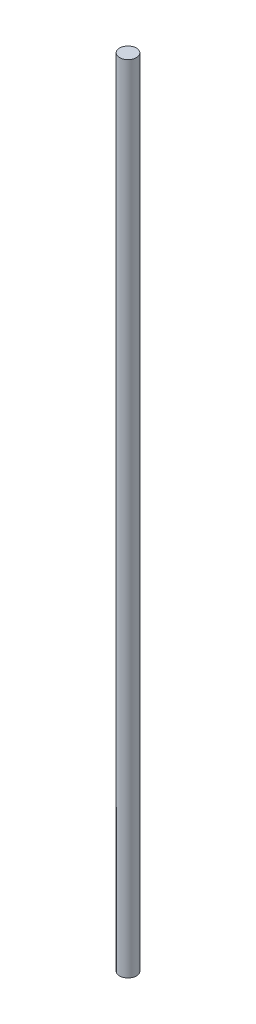
ISO-10303-21;
HEADER;
FILE_DESCRIPTION(('STEP AP214'),'2;1');
FILE_NAME('part.step','',(''),(''),'','','');
FILE_SCHEMA(('AUTOMOTIVE_DESIGN { 1 0 10303 214 1 1 1 1 }'));
ENDSEC;
DATA;
#1=APPLICATION_CONTEXT('core data for automotive mechanical design processes');
#2=APPLICATION_PROTOCOL_DEFINITION('international standard','automotive_design',2000,#1);
#3=PRODUCT_CONTEXT('',#1,'mechanical');
#4=PRODUCT('Part','Part','',(#3));
#5=PRODUCT_RELATED_PRODUCT_CATEGORY('part','',(#4));
#6=PRODUCT_DEFINITION_FORMATION('','',#4);
#7=PRODUCT_DEFINITION_CONTEXT('part definition',#1,'design');
#8=PRODUCT_DEFINITION('design','',#6,#7);
#9=PRODUCT_DEFINITION_SHAPE('','',#8);
#10=(LENGTH_UNIT() NAMED_UNIT(*) SI_UNIT(.MILLI.,.METRE.));
#11=(NAMED_UNIT(*) PLANE_ANGLE_UNIT() SI_UNIT($,.RADIAN.));
#12=(NAMED_UNIT(*) SI_UNIT($,.STERADIAN.) SOLID_ANGLE_UNIT());
#13=UNCERTAINTY_MEASURE_WITH_UNIT(LENGTH_MEASURE(1.E-05),#10,'distance_accuracy_value','');
#14=(GEOMETRIC_REPRESENTATION_CONTEXT(3) GLOBAL_UNCERTAINTY_ASSIGNED_CONTEXT((#13)) GLOBAL_UNIT_ASSIGNED_CONTEXT((#10,
#11,#12)) REPRESENTATION_CONTEXT('',''));
#15=CARTESIAN_POINT('',(0.,0.,0.));
#16=DIRECTION('',(0.,0.,1.));
#17=DIRECTION('',(1.,0.,0.));
#18=AXIS2_PLACEMENT_3D('',#15,#16,#17);
#19=CARTESIAN_POINT('',(0.,475.,0.));
#20=DIRECTION('',(0.,-1.,0.));
#21=DIRECTION('',(0.,0.,-1.));
#22=AXIS2_PLACEMENT_3D('',#19,#20,#21);
#23=CYLINDRICAL_SURFACE('',#22,5.);
#24=CARTESIAN_POINT('',(0.,475.,0.));
#25=DIRECTION('',(0.,1.,0.));
#26=DIRECTION('',(0.,0.,1.));
#27=AXIS2_PLACEMENT_3D('',#24,#25,#26);
#28=CIRCLE('',#27,5.);
#29=CARTESIAN_POINT('',(0.,475.,5.));
#30=VERTEX_POINT('',#29);
#31=EDGE_CURVE('E10',#30,#30,#28,.T.);
#32=ORIENTED_EDGE('',*,*,#31,.F.);
#33=EDGE_LOOP('',(#32));
#34=FACE_BOUND('',#33,.T.);
#35=CARTESIAN_POINT('',(0.,0.,0.));
#36=DIRECTION('',(0.,1.,0.));
#37=DIRECTION('',(0.,0.,1.));
#38=AXIS2_PLACEMENT_3D('',#35,#36,#37);
#39=CIRCLE('',#38,5.);
#40=CARTESIAN_POINT('',(0.,0.,5.));
#41=VERTEX_POINT('',#40);
#42=EDGE_CURVE('E40',#41,#41,#39,.T.);
#43=ORIENTED_EDGE('',*,*,#42,.T.);
#44=EDGE_LOOP('',(#43));
#45=FACE_BOUND('',#44,.T.);
#46=ADVANCED_FACE('F37',(#34,#45),#23,.T.);
#47=CARTESIAN_POINT('',(0.,475.,0.));
#48=DIRECTION('',(0.,1.,0.));
#49=DIRECTION('',(0.,0.,1.));
#50=AXIS2_PLACEMENT_3D('',#47,#48,#49);
#51=PLANE('',#50);
#52=ORIENTED_EDGE('',*,*,#31,.T.);
#53=EDGE_LOOP('',(#52));
#54=FACE_BOUND('',#53,.T.);
#55=ADVANCED_FACE('F54',(#54),#51,.T.);
#56=CARTESIAN_POINT('',(0.,0.,0.));
#57=DIRECTION('',(0.,1.,0.));
#58=DIRECTION('',(0.,0.,1.));
#59=AXIS2_PLACEMENT_3D('',#56,#57,#58);
#60=PLANE('',#59);
#61=ORIENTED_EDGE('',*,*,#42,.F.);
#62=EDGE_LOOP('',(#61));
#63=FACE_BOUND('',#62,.T.);
#64=ADVANCED_FACE('F52',(#63),#60,.F.);
#65=CLOSED_SHELL('',(#46,#55,#64));
#66=MANIFOLD_SOLID_BREP('B2',#65);
#67=ADVANCED_BREP_SHAPE_REPRESENTATION('',(#18,#66),#14);
#68=SHAPE_DEFINITION_REPRESENTATION(#9,#67);
ENDSEC;
END-ISO-10303-21;
